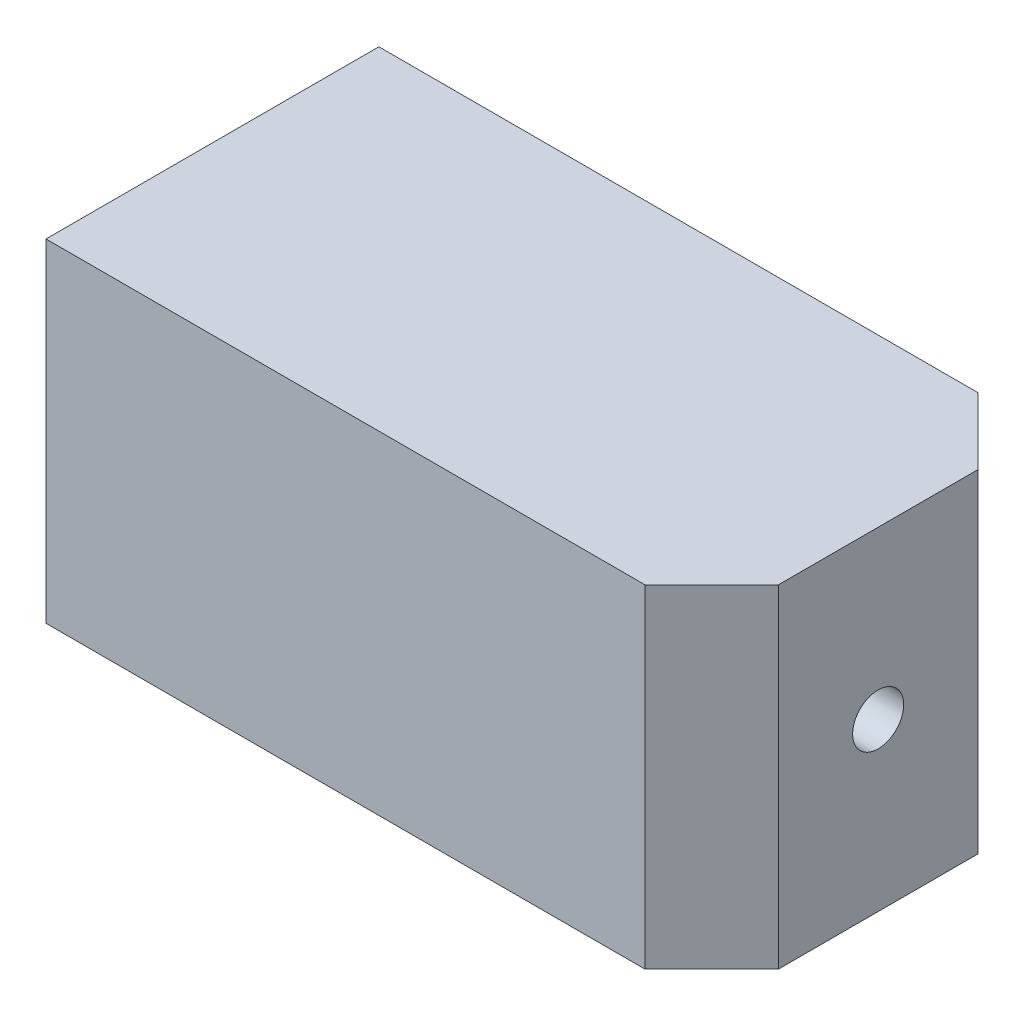
ISO-10303-21;
HEADER;
FILE_DESCRIPTION(('STEP AP214'),'2;1');
FILE_NAME('part.step','',(''),(''),'','','');
FILE_SCHEMA(('AUTOMOTIVE_DESIGN { 1 0 10303 214 1 1 1 1 }'));
ENDSEC;
DATA;
#1=APPLICATION_CONTEXT('core data for automotive mechanical design processes');
#2=APPLICATION_PROTOCOL_DEFINITION('international standard','automotive_design',2000,#1);
#3=PRODUCT_CONTEXT('',#1,'mechanical');
#4=PRODUCT('Part','Part','',(#3));
#5=PRODUCT_RELATED_PRODUCT_CATEGORY('part','',(#4));
#6=PRODUCT_DEFINITION_FORMATION('','',#4);
#7=PRODUCT_DEFINITION_CONTEXT('part definition',#1,'design');
#8=PRODUCT_DEFINITION('design','',#6,#7);
#9=PRODUCT_DEFINITION_SHAPE('','',#8);
#10=(LENGTH_UNIT() NAMED_UNIT(*) SI_UNIT(.MILLI.,.METRE.));
#11=(NAMED_UNIT(*) PLANE_ANGLE_UNIT() SI_UNIT($,.RADIAN.));
#12=(NAMED_UNIT(*) SI_UNIT($,.STERADIAN.) SOLID_ANGLE_UNIT());
#13=UNCERTAINTY_MEASURE_WITH_UNIT(LENGTH_MEASURE(1.E-05),#10,'distance_accuracy_value','');
#14=(GEOMETRIC_REPRESENTATION_CONTEXT(3) GLOBAL_UNCERTAINTY_ASSIGNED_CONTEXT((#13)) GLOBAL_UNIT_ASSIGNED_CONTEXT((#10,
#11,#12)) REPRESENTATION_CONTEXT('',''));
#15=CARTESIAN_POINT('',(0.,0.,0.));
#16=DIRECTION('',(0.,0.,1.));
#17=DIRECTION('',(1.,0.,0.));
#18=AXIS2_PLACEMENT_3D('',#15,#16,#17);
#19=CARTESIAN_POINT('',(15.,15.,-7.5));
#20=DIRECTION('',(-1.,0.,0.));
#21=DIRECTION('',(0.,0.,1.));
#22=AXIS2_PLACEMENT_3D('',#19,#20,#21);
#23=PLANE('',#22);
#24=CARTESIAN_POINT('',(15.,7.5,0.));
#25=DIRECTION('',(-1.,0.,0.));
#26=DIRECTION('',(0.,0.,1.));
#27=AXIS2_PLACEMENT_3D('',#24,#25,#26);
#28=CIRCLE('',#27,1.15);
#29=CARTESIAN_POINT('',(15.,7.5,1.15));
#30=VERTEX_POINT('',#29);
#31=EDGE_CURVE('E42',#30,#30,#28,.T.);
#32=ORIENTED_EDGE('',*,*,#31,.T.);
#33=EDGE_LOOP('',(#32));
#34=FACE_BOUND('',#33,.T.);
#35=DIRECTION('',(0.,0.,-1.));
#36=VECTOR('',#35,1.);
#37=CARTESIAN_POINT('',(15.,0.,-7.5));
#38=LINE('',#37,#36);
#39=CARTESIAN_POINT('',(15.,0.,4.5));
#40=VERTEX_POINT('',#39);
#41=CARTESIAN_POINT('',(15.,0.,-4.49999999999999));
#42=VERTEX_POINT('',#41);
#43=EDGE_CURVE('E122',#40,#42,#38,.T.);
#44=ORIENTED_EDGE('',*,*,#43,.T.);
#45=DIRECTION('',(0.,1.,0.));
#46=VECTOR('',#45,1.);
#47=CARTESIAN_POINT('',(15.,15.,-4.49999999999999));
#48=LINE('',#47,#46);
#49=CARTESIAN_POINT('',(15.,15.,-4.49999999999999));
#50=VERTEX_POINT('',#49);
#51=EDGE_CURVE('E60',#42,#50,#48,.T.);
#52=ORIENTED_EDGE('',*,*,#51,.T.);
#53=DIRECTION('',(0.,0.,-1.));
#54=VECTOR('',#53,1.);
#55=CARTESIAN_POINT('',(15.,15.,-7.5));
#56=LINE('',#55,#54);
#57=CARTESIAN_POINT('',(15.,15.,4.5));
#58=VERTEX_POINT('',#57);
#59=EDGE_CURVE('E103',#58,#50,#56,.T.);
#60=ORIENTED_EDGE('',*,*,#59,.F.);
#61=DIRECTION('',(0.,-1.,0.));
#62=VECTOR('',#61,1.);
#63=CARTESIAN_POINT('',(15.,15.,4.5));
#64=LINE('',#63,#62);
#65=EDGE_CURVE('E136',#58,#40,#64,.T.);
#66=ORIENTED_EDGE('',*,*,#65,.T.);
#67=EDGE_LOOP('',(#44,#52,#60,#66));
#68=FACE_BOUND('',#67,.T.);
#69=ADVANCED_FACE('F37',(#34,#68),#23,.F.);
#70=CARTESIAN_POINT('',(-15.,15.,-7.5));
#71=DIRECTION('',(0.,0.,1.));
#72=DIRECTION('',(1.,0.,0.));
#73=AXIS2_PLACEMENT_3D('',#70,#71,#72);
#74=PLANE('',#73);
#75=DIRECTION('',(-1.,0.,0.));
#76=VECTOR('',#75,1.);
#77=CARTESIAN_POINT('',(-15.,15.,-7.5));
#78=LINE('',#77,#76);
#79=CARTESIAN_POINT('',(12.,15.,-7.5));
#80=VERTEX_POINT('',#79);
#81=CARTESIAN_POINT('',(-15.,15.,-7.5));
#82=VERTEX_POINT('',#81);
#83=EDGE_CURVE('E93',#80,#82,#78,.T.);
#84=ORIENTED_EDGE('',*,*,#83,.F.);
#85=DIRECTION('',(0.,-1.,0.));
#86=VECTOR('',#85,1.);
#87=CARTESIAN_POINT('',(12.,15.,-7.5));
#88=LINE('',#87,#86);
#89=CARTESIAN_POINT('',(12.,0.,-7.5));
#90=VERTEX_POINT('',#89);
#91=EDGE_CURVE('E112',#80,#90,#88,.T.);
#92=ORIENTED_EDGE('',*,*,#91,.T.);
#93=DIRECTION('',(-1.,0.,0.));
#94=VECTOR('',#93,1.);
#95=CARTESIAN_POINT('',(-15.,0.,-7.5));
#96=LINE('',#95,#94);
#97=CARTESIAN_POINT('',(-15.,0.,-7.5));
#98=VERTEX_POINT('',#97);
#99=EDGE_CURVE('E109',#90,#98,#96,.T.);
#100=ORIENTED_EDGE('',*,*,#99,.T.);
#101=DIRECTION('',(0.,-1.,0.));
#102=VECTOR('',#101,1.);
#103=CARTESIAN_POINT('',(-15.,15.,-7.5));
#104=LINE('',#103,#102);
#105=EDGE_CURVE('E106',#82,#98,#104,.T.);
#106=ORIENTED_EDGE('',*,*,#105,.F.);
#107=EDGE_LOOP('',(#84,#92,#100,#106));
#108=FACE_BOUND('',#107,.T.);
#109=ADVANCED_FACE('F107',(#108),#74,.F.);
#110=CARTESIAN_POINT('',(-15.,15.,-7.5));
#111=DIRECTION('',(1.,0.,0.));
#112=DIRECTION('',(0.,0.,-1.));
#113=AXIS2_PLACEMENT_3D('',#110,#111,#112);
#114=PLANE('',#113);
#115=CARTESIAN_POINT('',(-15.,7.5,0.));
#116=DIRECTION('',(-1.,0.,0.));
#117=DIRECTION('',(0.,0.,1.));
#118=AXIS2_PLACEMENT_3D('',#115,#116,#117);
#119=CIRCLE('',#118,5.);
#120=CARTESIAN_POINT('',(-15.,7.5,5.));
#121=VERTEX_POINT('',#120);
#122=EDGE_CURVE('E199',#121,#121,#119,.T.);
#123=ORIENTED_EDGE('',*,*,#122,.F.);
#124=EDGE_LOOP('',(#123));
#125=FACE_BOUND('',#124,.T.);
#126=DIRECTION('',(0.,0.,1.));
#127=VECTOR('',#126,1.);
#128=CARTESIAN_POINT('',(-15.,0.,-7.5));
#129=LINE('',#128,#127);
#130=CARTESIAN_POINT('',(-15.,0.,7.5));
#131=VERTEX_POINT('',#130);
#132=EDGE_CURVE('E126',#98,#131,#129,.T.);
#133=ORIENTED_EDGE('',*,*,#132,.T.);
#134=DIRECTION('',(0.,-1.,0.));
#135=VECTOR('',#134,1.);
#136=CARTESIAN_POINT('',(-15.,15.,7.5));
#137=LINE('',#136,#135);
#138=CARTESIAN_POINT('',(-15.,15.,7.5));
#139=VERTEX_POINT('',#138);
#140=EDGE_CURVE('E113',#139,#131,#137,.T.);
#141=ORIENTED_EDGE('',*,*,#140,.F.);
#142=DIRECTION('',(0.,0.,1.));
#143=VECTOR('',#142,1.);
#144=CARTESIAN_POINT('',(-15.,15.,-7.5));
#145=LINE('',#144,#143);
#146=EDGE_CURVE('E97',#82,#139,#145,.T.);
#147=ORIENTED_EDGE('',*,*,#146,.F.);
#148=ORIENTED_EDGE('',*,*,#105,.T.);
#149=EDGE_LOOP('',(#133,#141,#147,#148));
#150=FACE_BOUND('',#149,.T.);
#151=ADVANCED_FACE('F115',(#125,#150),#114,.F.);
#152=CARTESIAN_POINT('',(-15.,15.,7.5));
#153=DIRECTION('',(0.,0.,-1.));
#154=DIRECTION('',(-1.,0.,0.));
#155=AXIS2_PLACEMENT_3D('',#152,#153,#154);
#156=PLANE('',#155);
#157=DIRECTION('',(1.,0.,0.));
#158=VECTOR('',#157,1.);
#159=CARTESIAN_POINT('',(-15.,0.,7.5));
#160=LINE('',#159,#158);
#161=CARTESIAN_POINT('',(12.,0.,7.5));
#162=VERTEX_POINT('',#161);
#163=EDGE_CURVE('E128',#131,#162,#160,.T.);
#164=ORIENTED_EDGE('',*,*,#163,.T.);
#165=DIRECTION('',(0.,1.,0.));
#166=VECTOR('',#165,1.);
#167=CARTESIAN_POINT('',(12.,15.,7.5));
#168=LINE('',#167,#166);
#169=CARTESIAN_POINT('',(12.,15.,7.5));
#170=VERTEX_POINT('',#169);
#171=EDGE_CURVE('E12',#162,#170,#168,.T.);
#172=ORIENTED_EDGE('',*,*,#171,.T.);
#173=DIRECTION('',(1.,0.,0.));
#174=VECTOR('',#173,1.);
#175=CARTESIAN_POINT('',(-15.,15.,7.5));
#176=LINE('',#175,#174);
#177=EDGE_CURVE('E117',#139,#170,#176,.T.);
#178=ORIENTED_EDGE('',*,*,#177,.F.);
#179=ORIENTED_EDGE('',*,*,#140,.T.);
#180=EDGE_LOOP('',(#164,#172,#178,#179));
#181=FACE_BOUND('',#180,.T.);
#182=ADVANCED_FACE('F149',(#181),#156,.F.);
#183=CARTESIAN_POINT('',(0.,15.,0.));
#184=DIRECTION('',(0.,1.,0.));
#185=DIRECTION('',(0.,0.,1.));
#186=AXIS2_PLACEMENT_3D('',#183,#184,#185);
#187=PLANE('',#186);
#188=ORIENTED_EDGE('',*,*,#59,.T.);
#189=DIRECTION('',(0.707106781186547,0.,0.707106781186548));
#190=VECTOR('',#189,1.);
#191=CARTESIAN_POINT('',(9.75000000000001,15.,-9.74999999999999));
#192=LINE('',#191,#190);
#193=EDGE_CURVE('E47',#50,#80,#192,.F.);
#194=ORIENTED_EDGE('',*,*,#193,.T.);
#195=ORIENTED_EDGE('',*,*,#83,.T.);
#196=ORIENTED_EDGE('',*,*,#146,.T.);
#197=ORIENTED_EDGE('',*,*,#177,.T.);
#198=DIRECTION('',(-0.707106781186548,0.,0.707106781186547));
#199=VECTOR('',#198,1.);
#200=CARTESIAN_POINT('',(9.74999999999998,15.,9.75000000000001));
#201=LINE('',#200,#199);
#202=EDGE_CURVE('E140',#170,#58,#201,.F.);
#203=ORIENTED_EDGE('',*,*,#202,.T.);
#204=EDGE_LOOP('',(#188,#194,#195,#196,#197,#203));
#205=FACE_BOUND('',#204,.T.);
#206=ADVANCED_FACE('F95',(#205),#187,.T.);
#207=CARTESIAN_POINT('',(0.,0.,0.));
#208=DIRECTION('',(0.,1.,0.));
#209=DIRECTION('',(0.,0.,1.));
#210=AXIS2_PLACEMENT_3D('',#207,#208,#209);
#211=PLANE('',#210);
#212=ORIENTED_EDGE('',*,*,#99,.F.);
#213=DIRECTION('',(-0.707106781186547,0.,-0.707106781186548));
#214=VECTOR('',#213,1.);
#215=CARTESIAN_POINT('',(12.,0.,-7.5));
#216=LINE('',#215,#214);
#217=EDGE_CURVE('E134',#90,#42,#216,.F.);
#218=ORIENTED_EDGE('',*,*,#217,.T.);
#219=ORIENTED_EDGE('',*,*,#43,.F.);
#220=DIRECTION('',(0.707106781186548,0.,-0.707106781186547));
#221=VECTOR('',#220,1.);
#222=CARTESIAN_POINT('',(15.,0.,4.5));
#223=LINE('',#222,#221);
#224=EDGE_CURVE('E132',#40,#162,#223,.F.);
#225=ORIENTED_EDGE('',*,*,#224,.T.);
#226=ORIENTED_EDGE('',*,*,#163,.F.);
#227=ORIENTED_EDGE('',*,*,#132,.F.);
#228=EDGE_LOOP('',(#212,#218,#219,#225,#226,#227));
#229=FACE_BOUND('',#228,.T.);
#230=ADVANCED_FACE('F148',(#229),#211,.F.);
#231=CARTESIAN_POINT('',(12.,15.,-7.5));
#232=DIRECTION('',(-0.707106781186548,0.,0.707106781186547));
#233=DIRECTION('',(0.,-1.,0.));
#234=AXIS2_PLACEMENT_3D('',#231,#232,#233);
#235=PLANE('',#234);
#236=ORIENTED_EDGE('',*,*,#193,.F.);
#237=ORIENTED_EDGE('',*,*,#51,.F.);
#238=ORIENTED_EDGE('',*,*,#217,.F.);
#239=ORIENTED_EDGE('',*,*,#91,.F.);
#240=EDGE_LOOP('',(#236,#237,#238,#239));
#241=FACE_BOUND('',#240,.T.);
#242=ADVANCED_FACE('F169',(#241),#235,.F.);
#243=CARTESIAN_POINT('',(15.,15.,4.5));
#244=DIRECTION('',(-0.707106781186547,0.,-0.707106781186548));
#245=DIRECTION('',(0.,-1.,0.));
#246=AXIS2_PLACEMENT_3D('',#243,#244,#245);
#247=PLANE('',#246);
#248=ORIENTED_EDGE('',*,*,#202,.F.);
#249=ORIENTED_EDGE('',*,*,#171,.F.);
#250=ORIENTED_EDGE('',*,*,#224,.F.);
#251=ORIENTED_EDGE('',*,*,#65,.F.);
#252=EDGE_LOOP('',(#248,#249,#250,#251));
#253=FACE_BOUND('',#252,.T.);
#254=ADVANCED_FACE('F40',(#253),#247,.F.);
#255=CARTESIAN_POINT('',(29.142135623731,7.5,0.));
#256=DIRECTION('',(-1.,0.,0.));
#257=DIRECTION('',(0.,0.,1.));
#258=AXIS2_PLACEMENT_3D('',#255,#256,#257);
#259=CYLINDRICAL_SURFACE('',#258,5.);
#260=CARTESIAN_POINT('',(12.,7.5,0.));
#261=DIRECTION('',(-1.,0.,0.));
#262=DIRECTION('',(0.,0.,1.));
#263=AXIS2_PLACEMENT_3D('',#260,#261,#262);
#264=CIRCLE('',#263,5.);
#265=CARTESIAN_POINT('',(12.,7.5,5.));
#266=VERTEX_POINT('',#265);
#267=EDGE_CURVE('E124',#266,#266,#264,.F.);
#268=ORIENTED_EDGE('',*,*,#267,.T.);
#269=EDGE_LOOP('',(#268));
#270=FACE_BOUND('',#269,.T.);
#271=ORIENTED_EDGE('',*,*,#122,.T.);
#272=EDGE_LOOP('',(#271));
#273=FACE_BOUND('',#272,.T.);
#274=ADVANCED_FACE('F178',(#270,#273),#259,.F.);
#275=CARTESIAN_POINT('',(12.,15.,-7.5));
#276=DIRECTION('',(-1.,0.,0.));
#277=DIRECTION('',(0.,0.,1.));
#278=AXIS2_PLACEMENT_3D('',#275,#276,#277);
#279=PLANE('',#278);
#280=CARTESIAN_POINT('',(12.,7.5,0.));
#281=DIRECTION('',(-1.,0.,0.));
#282=DIRECTION('',(0.,0.,1.));
#283=AXIS2_PLACEMENT_3D('',#280,#281,#282);
#284=CIRCLE('',#283,1.15);
#285=CARTESIAN_POINT('',(12.,7.5,1.15));
#286=VERTEX_POINT('',#285);
#287=EDGE_CURVE('E197',#286,#286,#284,.T.);
#288=ORIENTED_EDGE('',*,*,#287,.F.);
#289=EDGE_LOOP('',(#288));
#290=FACE_BOUND('',#289,.T.);
#291=ORIENTED_EDGE('',*,*,#267,.F.);
#292=EDGE_LOOP('',(#291));
#293=FACE_BOUND('',#292,.T.);
#294=ADVANCED_FACE('F184',(#290,#293),#279,.T.);
#295=CARTESIAN_POINT('',(19.,7.5,0.));
#296=DIRECTION('',(-1.,0.,0.));
#297=DIRECTION('',(0.,0.,1.));
#298=AXIS2_PLACEMENT_3D('',#295,#296,#297);
#299=CYLINDRICAL_SURFACE('',#298,1.15);
#300=ORIENTED_EDGE('',*,*,#287,.T.);
#301=EDGE_LOOP('',(#300));
#302=FACE_BOUND('',#301,.T.);
#303=ORIENTED_EDGE('',*,*,#31,.F.);
#304=EDGE_LOOP('',(#303));
#305=FACE_BOUND('',#304,.T.);
#306=ADVANCED_FACE('F188',(#302,#305),#299,.F.);
#307=CLOSED_SHELL('',(#69,#109,#151,#182,#206,#230,#242,#254,#274,#294,#306));
#308=MANIFOLD_SOLID_BREP('B2',#307);
#309=ADVANCED_BREP_SHAPE_REPRESENTATION('',(#18,#308),#14);
#310=SHAPE_DEFINITION_REPRESENTATION(#9,#309);
ENDSEC;
END-ISO-10303-21;
